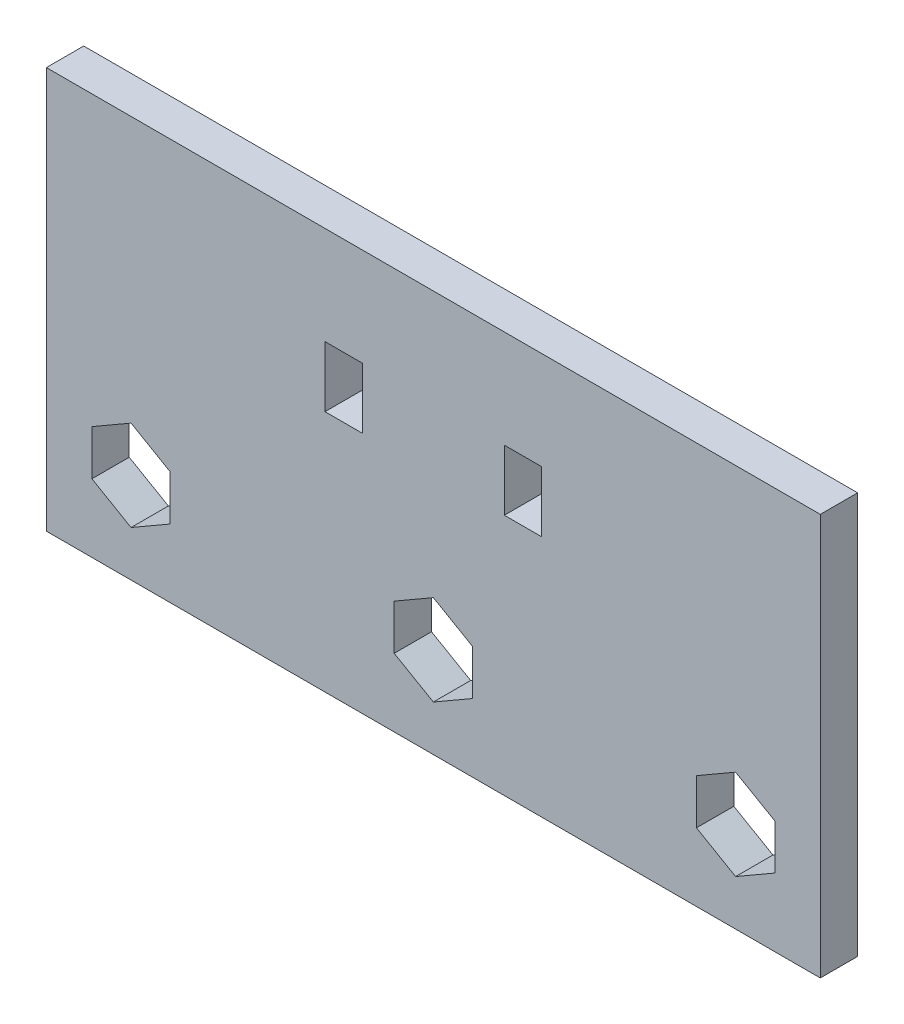
ISO-10303-21;
HEADER;
FILE_DESCRIPTION(('STEP AP214'),'2;1');
FILE_NAME('part.step','',(''),(''),'','','');
FILE_SCHEMA(('AUTOMOTIVE_DESIGN { 1 0 10303 214 1 1 1 1 }'));
ENDSEC;
DATA;
#1=APPLICATION_CONTEXT('core data for automotive mechanical design processes');
#2=APPLICATION_PROTOCOL_DEFINITION('international standard','automotive_design',2000,#1);
#3=PRODUCT_CONTEXT('',#1,'mechanical');
#4=PRODUCT('Part','Part','',(#3));
#5=PRODUCT_RELATED_PRODUCT_CATEGORY('part','',(#4));
#6=PRODUCT_DEFINITION_FORMATION('','',#4);
#7=PRODUCT_DEFINITION_CONTEXT('part definition',#1,'design');
#8=PRODUCT_DEFINITION('design','',#6,#7);
#9=PRODUCT_DEFINITION_SHAPE('','',#8);
#10=(LENGTH_UNIT() NAMED_UNIT(*) SI_UNIT(.MILLI.,.METRE.));
#11=(NAMED_UNIT(*) PLANE_ANGLE_UNIT() SI_UNIT($,.RADIAN.));
#12=(NAMED_UNIT(*) SI_UNIT($,.STERADIAN.) SOLID_ANGLE_UNIT());
#13=UNCERTAINTY_MEASURE_WITH_UNIT(LENGTH_MEASURE(1.E-05),#10,'distance_accuracy_value','');
#14=(GEOMETRIC_REPRESENTATION_CONTEXT(3) GLOBAL_UNCERTAINTY_ASSIGNED_CONTEXT((#13)) GLOBAL_UNIT_ASSIGNED_CONTEXT((#10,
#11,#12)) REPRESENTATION_CONTEXT('',''));
#15=CARTESIAN_POINT('',(0.,0.,0.));
#16=DIRECTION('',(0.,0.,1.));
#17=DIRECTION('',(1.,0.,0.));
#18=AXIS2_PLACEMENT_3D('',#15,#16,#17);
#19=CARTESIAN_POINT('',(0.,0.,5.207));
#20=DIRECTION('',(0.,0.,-1.));
#21=DIRECTION('',(-1.,0.,0.));
#22=AXIS2_PLACEMENT_3D('',#19,#20,#21);
#23=PLANE('',#22);
#24=DIRECTION('',(0.86602540378444,-0.499999999999998,0.));
#25=VECTOR('',#24,1.);
#26=CARTESIAN_POINT('',(16.2433806570155,28.1343605846325,5.207));
#27=LINE('',#26,#25);
#28=CARTESIAN_POINT('',(48.514,9.50290982004454,5.207));
#29=VERTEX_POINT('',#28);
#30=CARTESIAN_POINT('',(53.975,6.35,5.207));
#31=VERTEX_POINT('',#30);
#32=EDGE_CURVE('E321',#29,#31,#27,.T.);
#33=ORIENTED_EDGE('',*,*,#32,.F.);
#34=DIRECTION('',(0.,-1.,0.));
#35=VECTOR('',#34,1.);
#36=CARTESIAN_POINT('',(48.514,0.,5.207));
#37=LINE('',#36,#35);
#38=CARTESIAN_POINT('',(48.514,15.8087294601336,5.207));
#39=VERTEX_POINT('',#38);
#40=EDGE_CURVE('E310',#39,#29,#37,.T.);
#41=ORIENTED_EDGE('',*,*,#40,.F.);
#42=DIRECTION('',(-0.866025403784436,-0.500000000000004,0.));
#43=VECTOR('',#42,1.);
#44=CARTESIAN_POINT('',(5.28311934298456,-9.15063112449907,5.207));
#45=LINE('',#44,#43);
#46=CARTESIAN_POINT('',(53.975,18.9616392801782,5.207));
#47=VERTEX_POINT('',#46);
#48=EDGE_CURVE('E312',#47,#39,#45,.T.);
#49=ORIENTED_EDGE('',*,*,#48,.F.);
#50=DIRECTION('',(-0.86602540378444,0.499999999999998,0.));
#51=VECTOR('',#50,1.);
#52=CARTESIAN_POINT('',(21.7043806570155,37.5930900447662,5.207));
#53=LINE('',#52,#51);
#54=CARTESIAN_POINT('',(59.436,15.8087294601337,5.207));
#55=VERTEX_POINT('',#54);
#56=EDGE_CURVE('E315',#55,#47,#53,.T.);
#57=ORIENTED_EDGE('',*,*,#56,.F.);
#58=DIRECTION('',(0.,1.,0.));
#59=VECTOR('',#58,1.);
#60=CARTESIAN_POINT('',(59.436,0.,5.207));
#61=LINE('',#60,#59);
#62=CARTESIAN_POINT('',(59.436,9.50290982004458,5.207));
#63=VERTEX_POINT('',#62);
#64=EDGE_CURVE('E317',#63,#55,#61,.T.);
#65=ORIENTED_EDGE('',*,*,#64,.F.);
#66=DIRECTION('',(0.866025403784436,0.500000000000004,0.));
#67=VECTOR('',#66,1.);
#68=CARTESIAN_POINT('',(10.7441193429846,-18.6093605846327,5.207));
#69=LINE('',#68,#67);
#70=EDGE_CURVE('E319',#31,#63,#69,.T.);
#71=ORIENTED_EDGE('',*,*,#70,.F.);
#72=EDGE_LOOP('',(#33,#41,#49,#57,#65,#71));
#73=FACE_BOUND('',#72,.T.);
#74=DIRECTION('',(0.,-1.,0.));
#75=VECTOR('',#74,1.);
#76=CARTESIAN_POINT('',(0.,0.,5.207));
#77=LINE('',#76,#75);
#78=CARTESIAN_POINT('',(0.,56.007,5.207));
#79=VERTEX_POINT('',#78);
#80=CARTESIAN_POINT('',(0.,0.,5.207));
#81=VERTEX_POINT('',#80);
#82=EDGE_CURVE('E430',#79,#81,#77,.T.);
#83=ORIENTED_EDGE('',*,*,#82,.T.);
#84=DIRECTION('',(1.,0.,0.));
#85=VECTOR('',#84,1.);
#86=CARTESIAN_POINT('',(0.,0.,5.207));
#87=LINE('',#86,#85);
#88=CARTESIAN_POINT('',(107.95,0.,5.207));
#89=VERTEX_POINT('',#88);
#90=EDGE_CURVE('E433',#81,#89,#87,.T.);
#91=ORIENTED_EDGE('',*,*,#90,.T.);
#92=DIRECTION('',(0.,1.,0.));
#93=VECTOR('',#92,1.);
#94=CARTESIAN_POINT('',(107.95,0.,5.207));
#95=LINE('',#94,#93);
#96=CARTESIAN_POINT('',(107.95,56.007,5.207));
#97=VERTEX_POINT('',#96);
#98=EDGE_CURVE('E436',#89,#97,#95,.T.);
#99=ORIENTED_EDGE('',*,*,#98,.T.);
#100=DIRECTION('',(-1.,0.,0.));
#101=VECTOR('',#100,1.);
#102=CARTESIAN_POINT('',(0.,56.007,5.207));
#103=LINE('',#102,#101);
#104=EDGE_CURVE('E438',#97,#79,#103,.T.);
#105=ORIENTED_EDGE('',*,*,#104,.T.);
#106=EDGE_LOOP('',(#83,#91,#99,#105));
#107=FACE_BOUND('',#106,.T.);
#108=DIRECTION('',(-1.,0.,0.));
#109=VECTOR('',#108,1.);
#110=CARTESIAN_POINT('',(44.0690000000001,42.3333333333334,5.20700000000001));
#111=LINE('',#110,#109);
#112=CARTESIAN_POINT('',(44.0690000000001,42.3333333333334,5.20700000000001));
#113=VERTEX_POINT('',#112);
#114=CARTESIAN_POINT('',(38.8620000000001,42.3333333333334,5.207));
#115=VERTEX_POINT('',#114);
#116=EDGE_CURVE('E408',#113,#115,#111,.T.);
#117=ORIENTED_EDGE('',*,*,#116,.F.);
#118=DIRECTION('',(0.,-1.,0.));
#119=VECTOR('',#118,1.);
#120=CARTESIAN_POINT('',(44.0690000000001,0.,5.207));
#121=LINE('',#120,#119);
#122=CARTESIAN_POINT('',(44.0690000000001,33.8666666666667,5.20700000000001));
#123=VERTEX_POINT('',#122);
#124=EDGE_CURVE('E426',#113,#123,#121,.T.);
#125=ORIENTED_EDGE('',*,*,#124,.T.);
#126=DIRECTION('',(-1.,0.,0.));
#127=VECTOR('',#126,1.);
#128=CARTESIAN_POINT('',(44.0690000000001,33.8666666666667,5.20700000000001));
#129=LINE('',#128,#127);
#130=CARTESIAN_POINT('',(38.8620000000001,33.8666666666667,5.20700000000001));
#131=VERTEX_POINT('',#130);
#132=EDGE_CURVE('E421',#123,#131,#129,.T.);
#133=ORIENTED_EDGE('',*,*,#132,.T.);
#134=DIRECTION('',(0.,-1.,0.));
#135=VECTOR('',#134,1.);
#136=CARTESIAN_POINT('',(38.8620000000001,0.,5.207));
#137=LINE('',#136,#135);
#138=EDGE_CURVE('E424',#115,#131,#137,.T.);
#139=ORIENTED_EDGE('',*,*,#138,.F.);
#140=EDGE_LOOP('',(#117,#125,#133,#139));
#141=FACE_BOUND('',#140,.T.);
#142=DIRECTION('',(1.,0.,0.));
#143=VECTOR('',#142,1.);
#144=CARTESIAN_POINT('',(63.8810000000001,33.8666666666667,5.207));
#145=LINE('',#144,#143);
#146=CARTESIAN_POINT('',(63.8810000000001,33.8666666666667,5.207));
#147=VERTEX_POINT('',#146);
#148=CARTESIAN_POINT('',(69.0880000000001,33.8666666666667,5.207));
#149=VERTEX_POINT('',#148);
#150=EDGE_CURVE('E377',#147,#149,#145,.T.);
#151=ORIENTED_EDGE('',*,*,#150,.F.);
#152=DIRECTION('',(0.,1.,0.));
#153=VECTOR('',#152,1.);
#154=CARTESIAN_POINT('',(63.8810000000001,0.,5.207));
#155=LINE('',#154,#153);
#156=CARTESIAN_POINT('',(63.8810000000001,42.3333333333334,5.207));
#157=VERTEX_POINT('',#156);
#158=EDGE_CURVE('E395',#147,#157,#155,.T.);
#159=ORIENTED_EDGE('',*,*,#158,.T.);
#160=DIRECTION('',(1.,0.,0.));
#161=VECTOR('',#160,1.);
#162=CARTESIAN_POINT('',(63.8810000000001,42.3333333333334,5.207));
#163=LINE('',#162,#161);
#164=CARTESIAN_POINT('',(69.0880000000001,42.3333333333334,5.207));
#165=VERTEX_POINT('',#164);
#166=EDGE_CURVE('E390',#157,#165,#163,.T.);
#167=ORIENTED_EDGE('',*,*,#166,.T.);
#168=DIRECTION('',(0.,1.,0.));
#169=VECTOR('',#168,1.);
#170=CARTESIAN_POINT('',(69.0880000000001,0.,5.207));
#171=LINE('',#170,#169);
#172=EDGE_CURVE('E393',#149,#165,#171,.T.);
#173=ORIENTED_EDGE('',*,*,#172,.F.);
#174=EDGE_LOOP('',(#151,#159,#167,#173));
#175=FACE_BOUND('',#174,.T.);
#176=DIRECTION('',(0.,-1.,0.));
#177=VECTOR('',#176,1.);
#178=CARTESIAN_POINT('',(90.678,0.,5.207));
#179=LINE('',#178,#177);
#180=CARTESIAN_POINT('',(90.678,15.8087294601336,5.207));
#181=VERTEX_POINT('',#180);
#182=CARTESIAN_POINT('',(90.678,9.50290982004454,5.207));
#183=VERTEX_POINT('',#182);
#184=EDGE_CURVE('E365',#181,#183,#179,.T.);
#185=ORIENTED_EDGE('',*,*,#184,.F.);
#186=DIRECTION('',(-0.86602540378444,-0.499999999999998,0.));
#187=VECTOR('',#186,1.);
#188=CARTESIAN_POINT('',(15.8241193429842,-27.4081786870823,5.207));
#189=LINE('',#188,#187);
#190=CARTESIAN_POINT('',(96.139,18.9616392801782,5.207));
#191=VERTEX_POINT('',#190);
#192=EDGE_CURVE('E354',#191,#181,#189,.T.);
#193=ORIENTED_EDGE('',*,*,#192,.F.);
#194=DIRECTION('',(-0.86602540378444,0.499999999999998,0.));
#195=VECTOR('',#194,1.);
#196=CARTESIAN_POINT('',(32.2453806570154,55.8506376073496,5.207));
#197=LINE('',#196,#195);
#198=CARTESIAN_POINT('',(101.6,15.8087294601336,5.207));
#199=VERTEX_POINT('',#198);
#200=EDGE_CURVE('E356',#199,#191,#197,.T.);
#201=ORIENTED_EDGE('',*,*,#200,.F.);
#202=DIRECTION('',(0.,1.,0.));
#203=VECTOR('',#202,1.);
#204=CARTESIAN_POINT('',(101.6,0.,5.207));
#205=LINE('',#204,#203);
#206=CARTESIAN_POINT('',(101.6,9.50290982004454,5.207));
#207=VERTEX_POINT('',#206);
#208=EDGE_CURVE('E359',#207,#199,#205,.T.);
#209=ORIENTED_EDGE('',*,*,#208,.F.);
#210=DIRECTION('',(0.86602540378444,0.499999999999998,0.));
#211=VECTOR('',#210,1.);
#212=CARTESIAN_POINT('',(21.2851193429842,-36.8669081472159,5.207));
#213=LINE('',#212,#211);
#214=CARTESIAN_POINT('',(96.139,6.35000000000001,5.207));
#215=VERTEX_POINT('',#214);
#216=EDGE_CURVE('E361',#215,#207,#213,.T.);
#217=ORIENTED_EDGE('',*,*,#216,.F.);
#218=DIRECTION('',(0.86602540378444,-0.499999999999998,0.));
#219=VECTOR('',#218,1.);
#220=CARTESIAN_POINT('',(26.7843806570154,46.391908147216,5.207));
#221=LINE('',#220,#219);
#222=EDGE_CURVE('E363',#183,#215,#221,.T.);
#223=ORIENTED_EDGE('',*,*,#222,.F.);
#224=EDGE_LOOP('',(#185,#193,#201,#209,#217,#223));
#225=FACE_BOUND('',#224,.T.);
#226=DIRECTION('',(-0.86602540378444,-0.499999999999998,0.));
#227=VECTOR('',#226,1.);
#228=CARTESIAN_POINT('',(-5.25788065701559,9.10691643808469,5.207));
#229=LINE('',#228,#227);
#230=CARTESIAN_POINT('',(11.811,18.9616392801782,5.207));
#231=VERTEX_POINT('',#230);
#232=CARTESIAN_POINT('',(6.35,15.8087294601336,5.207));
#233=VERTEX_POINT('',#232);
#234=EDGE_CURVE('E233',#231,#233,#229,.T.);
#235=ORIENTED_EDGE('',*,*,#234,.F.);
#236=DIRECTION('',(-0.866025403784436,0.500000000000004,0.));
#237=VECTOR('',#236,1.);
#238=CARTESIAN_POINT('',(11.1633806570157,19.3355424821826,5.207));
#239=LINE('',#238,#237);
#240=CARTESIAN_POINT('',(17.272,15.8087294601336,5.207));
#241=VERTEX_POINT('',#240);
#242=EDGE_CURVE('E236',#241,#231,#239,.T.);
#243=ORIENTED_EDGE('',*,*,#242,.F.);
#244=DIRECTION('',(0.,1.,0.));
#245=VECTOR('',#244,1.);
#246=CARTESIAN_POINT('',(17.272,0.,5.207));
#247=LINE('',#246,#245);
#248=CARTESIAN_POINT('',(17.272,9.50290982004451,5.207));
#249=VERTEX_POINT('',#248);
#250=EDGE_CURVE('E270',#249,#241,#247,.T.);
#251=ORIENTED_EDGE('',*,*,#250,.F.);
#252=DIRECTION('',(0.86602540378444,0.499999999999998,0.));
#253=VECTOR('',#252,1.);
#254=CARTESIAN_POINT('',(0.203119342984393,-0.35181302204898,5.207));
#255=LINE('',#254,#253);
#256=CARTESIAN_POINT('',(11.811,6.34999999999998,5.207));
#257=VERTEX_POINT('',#256);
#258=EDGE_CURVE('E272',#257,#249,#255,.T.);
#259=ORIENTED_EDGE('',*,*,#258,.F.);
#260=DIRECTION('',(0.866025403784436,-0.500000000000004,0.));
#261=VECTOR('',#260,1.);
#262=CARTESIAN_POINT('',(5.70238065701565,9.87681302204898,5.207));
#263=LINE('',#262,#261);
#264=CARTESIAN_POINT('',(6.35,9.50290982004455,5.207));
#265=VERTEX_POINT('',#264);
#266=EDGE_CURVE('E274',#265,#257,#263,.T.);
#267=ORIENTED_EDGE('',*,*,#266,.F.);
#268=DIRECTION('',(0.,-1.,0.));
#269=VECTOR('',#268,1.);
#270=CARTESIAN_POINT('',(6.35,0.,5.207));
#271=LINE('',#270,#269);
#272=EDGE_CURVE('E276',#233,#265,#271,.T.);
#273=ORIENTED_EDGE('',*,*,#272,.F.);
#274=EDGE_LOOP('',(#235,#243,#251,#259,#267,#273));
#275=FACE_BOUND('',#274,.T.);
#276=ADVANCED_FACE('F33',(#73,#107,#141,#175,#225,#275),#23,.F.);
#277=CARTESIAN_POINT('',(0.,0.,0.));
#278=DIRECTION('',(0.,0.,-1.));
#279=DIRECTION('',(-1.,0.,0.));
#280=AXIS2_PLACEMENT_3D('',#277,#278,#279);
#281=PLANE('',#280);
#282=DIRECTION('',(0.,-1.,0.));
#283=VECTOR('',#282,1.);
#284=CARTESIAN_POINT('',(48.514,9.50290982004454,0.));
#285=LINE('',#284,#283);
#286=CARTESIAN_POINT('',(48.514,15.8087294601336,0.));
#287=VERTEX_POINT('',#286);
#288=CARTESIAN_POINT('',(48.514,9.50290982004454,0.));
#289=VERTEX_POINT('',#288);
#290=EDGE_CURVE('E294',#287,#289,#285,.T.);
#291=ORIENTED_EDGE('',*,*,#290,.T.);
#292=DIRECTION('',(0.86602540378444,-0.499999999999998,0.));
#293=VECTOR('',#292,1.);
#294=CARTESIAN_POINT('',(53.975,6.35,0.));
#295=LINE('',#294,#293);
#296=CARTESIAN_POINT('',(53.975,6.35,0.));
#297=VERTEX_POINT('',#296);
#298=EDGE_CURVE('E279',#289,#297,#295,.T.);
#299=ORIENTED_EDGE('',*,*,#298,.T.);
#300=DIRECTION('',(0.866025403784436,0.500000000000004,0.));
#301=VECTOR('',#300,1.);
#302=CARTESIAN_POINT('',(59.436,9.50290982004458,0.));
#303=LINE('',#302,#301);
#304=CARTESIAN_POINT('',(59.436,9.50290982004458,0.));
#305=VERTEX_POINT('',#304);
#306=EDGE_CURVE('E282',#297,#305,#303,.T.);
#307=ORIENTED_EDGE('',*,*,#306,.T.);
#308=DIRECTION('',(0.,1.,0.));
#309=VECTOR('',#308,1.);
#310=CARTESIAN_POINT('',(59.436,15.8087294601337,0.));
#311=LINE('',#310,#309);
#312=CARTESIAN_POINT('',(59.436,15.8087294601337,0.));
#313=VERTEX_POINT('',#312);
#314=EDGE_CURVE('E285',#305,#313,#311,.T.);
#315=ORIENTED_EDGE('',*,*,#314,.T.);
#316=DIRECTION('',(-0.86602540378444,0.499999999999998,0.));
#317=VECTOR('',#316,1.);
#318=CARTESIAN_POINT('',(53.975,18.9616392801782,0.));
#319=LINE('',#318,#317);
#320=CARTESIAN_POINT('',(53.975,18.9616392801782,0.));
#321=VERTEX_POINT('',#320);
#322=EDGE_CURVE('E288',#313,#321,#319,.T.);
#323=ORIENTED_EDGE('',*,*,#322,.T.);
#324=DIRECTION('',(-0.866025403784436,-0.500000000000004,0.));
#325=VECTOR('',#324,1.);
#326=CARTESIAN_POINT('',(48.514,15.8087294601336,0.));
#327=LINE('',#326,#325);
#328=EDGE_CURVE('E291',#321,#287,#327,.T.);
#329=ORIENTED_EDGE('',*,*,#328,.T.);
#330=EDGE_LOOP('',(#291,#299,#307,#315,#323,#329));
#331=FACE_BOUND('',#330,.T.);
#332=DIRECTION('',(0.,-1.,0.));
#333=VECTOR('',#332,1.);
#334=CARTESIAN_POINT('',(0.,0.,0.));
#335=LINE('',#334,#333);
#336=CARTESIAN_POINT('',(0.,56.007,0.));
#337=VERTEX_POINT('',#336);
#338=CARTESIAN_POINT('',(0.,0.,0.));
#339=VERTEX_POINT('',#338);
#340=EDGE_CURVE('E429',#337,#339,#335,.T.);
#341=ORIENTED_EDGE('',*,*,#340,.F.);
#342=DIRECTION('',(-1.,0.,0.));
#343=VECTOR('',#342,1.);
#344=CARTESIAN_POINT('',(0.,56.007,0.));
#345=LINE('',#344,#343);
#346=CARTESIAN_POINT('',(107.95,56.007,0.));
#347=VERTEX_POINT('',#346);
#348=EDGE_CURVE('E434',#347,#337,#345,.T.);
#349=ORIENTED_EDGE('',*,*,#348,.F.);
#350=DIRECTION('',(0.,1.,0.));
#351=VECTOR('',#350,1.);
#352=CARTESIAN_POINT('',(107.95,0.,0.));
#353=LINE('',#352,#351);
#354=CARTESIAN_POINT('',(107.95,0.,0.));
#355=VERTEX_POINT('',#354);
#356=EDGE_CURVE('E445',#355,#347,#353,.T.);
#357=ORIENTED_EDGE('',*,*,#356,.F.);
#358=DIRECTION('',(1.,0.,0.));
#359=VECTOR('',#358,1.);
#360=CARTESIAN_POINT('',(0.,0.,0.));
#361=LINE('',#360,#359);
#362=EDGE_CURVE('E443',#339,#355,#361,.T.);
#363=ORIENTED_EDGE('',*,*,#362,.F.);
#364=EDGE_LOOP('',(#341,#349,#357,#363));
#365=FACE_BOUND('',#364,.T.);
#366=DIRECTION('',(0.,1.,0.));
#367=VECTOR('',#366,1.);
#368=CARTESIAN_POINT('',(44.0690000000001,33.8666666666667,0.));
#369=LINE('',#368,#367);
#370=CARTESIAN_POINT('',(44.0690000000001,33.8666666666667,0.));
#371=VERTEX_POINT('',#370);
#372=CARTESIAN_POINT('',(44.0690000000001,42.3333333333334,0.));
#373=VERTEX_POINT('',#372);
#374=EDGE_CURVE('E401',#371,#373,#369,.T.);
#375=ORIENTED_EDGE('',*,*,#374,.T.);
#376=DIRECTION('',(-1.,0.,0.));
#377=VECTOR('',#376,1.);
#378=CARTESIAN_POINT('',(44.0690000000001,42.3333333333334,0.));
#379=LINE('',#378,#377);
#380=CARTESIAN_POINT('',(38.8620000000001,42.3333333333334,0.));
#381=VERTEX_POINT('',#380);
#382=EDGE_CURVE('E416',#373,#381,#379,.T.);
#383=ORIENTED_EDGE('',*,*,#382,.T.);
#384=DIRECTION('',(0.,1.,0.));
#385=VECTOR('',#384,1.);
#386=CARTESIAN_POINT('',(38.8620000000001,33.8666666666667,0.));
#387=LINE('',#386,#385);
#388=CARTESIAN_POINT('',(38.8620000000001,33.8666666666667,0.));
#389=VERTEX_POINT('',#388);
#390=EDGE_CURVE('E411',#389,#381,#387,.T.);
#391=ORIENTED_EDGE('',*,*,#390,.F.);
#392=DIRECTION('',(-1.,0.,0.));
#393=VECTOR('',#392,1.);
#394=CARTESIAN_POINT('',(44.0690000000001,33.8666666666667,0.));
#395=LINE('',#394,#393);
#396=EDGE_CURVE('E419',#371,#389,#395,.T.);
#397=ORIENTED_EDGE('',*,*,#396,.F.);
#398=EDGE_LOOP('',(#375,#383,#391,#397));
#399=FACE_BOUND('',#398,.T.);
#400=DIRECTION('',(0.,-1.,0.));
#401=VECTOR('',#400,1.);
#402=CARTESIAN_POINT('',(63.8810000000001,33.8666666666667,0.));
#403=LINE('',#402,#401);
#404=CARTESIAN_POINT('',(63.8810000000001,42.3333333333334,0.));
#405=VERTEX_POINT('',#404);
#406=CARTESIAN_POINT('',(63.8810000000001,33.8666666666667,0.));
#407=VERTEX_POINT('',#406);
#408=EDGE_CURVE('E370',#405,#407,#403,.T.);
#409=ORIENTED_EDGE('',*,*,#408,.T.);
#410=DIRECTION('',(1.,0.,0.));
#411=VECTOR('',#410,1.);
#412=CARTESIAN_POINT('',(63.8810000000001,33.8666666666667,0.));
#413=LINE('',#412,#411);
#414=CARTESIAN_POINT('',(69.0880000000001,33.8666666666667,0.));
#415=VERTEX_POINT('',#414);
#416=EDGE_CURVE('E385',#407,#415,#413,.T.);
#417=ORIENTED_EDGE('',*,*,#416,.T.);
#418=DIRECTION('',(0.,-1.,0.));
#419=VECTOR('',#418,1.);
#420=CARTESIAN_POINT('',(69.0880000000001,33.8666666666667,0.));
#421=LINE('',#420,#419);
#422=CARTESIAN_POINT('',(69.0880000000001,42.3333333333334,0.));
#423=VERTEX_POINT('',#422);
#424=EDGE_CURVE('E380',#423,#415,#421,.T.);
#425=ORIENTED_EDGE('',*,*,#424,.F.);
#426=DIRECTION('',(1.,0.,0.));
#427=VECTOR('',#426,1.);
#428=CARTESIAN_POINT('',(63.8810000000001,42.3333333333334,0.));
#429=LINE('',#428,#427);
#430=EDGE_CURVE('E388',#405,#423,#429,.T.);
#431=ORIENTED_EDGE('',*,*,#430,.F.);
#432=EDGE_LOOP('',(#409,#417,#425,#431));
#433=FACE_BOUND('',#432,.T.);
#434=DIRECTION('',(-0.86602540378444,-0.499999999999998,0.));
#435=VECTOR('',#434,1.);
#436=CARTESIAN_POINT('',(90.678,15.8087294601336,0.));
#437=LINE('',#436,#435);
#438=CARTESIAN_POINT('',(96.139,18.9616392801782,0.));
#439=VERTEX_POINT('',#438);
#440=CARTESIAN_POINT('',(90.678,15.8087294601336,0.));
#441=VERTEX_POINT('',#440);
#442=EDGE_CURVE('E338',#439,#441,#437,.T.);
#443=ORIENTED_EDGE('',*,*,#442,.T.);
#444=DIRECTION('',(0.,-1.,0.));
#445=VECTOR('',#444,1.);
#446=CARTESIAN_POINT('',(90.678,9.50290982004454,0.));
#447=LINE('',#446,#445);
#448=CARTESIAN_POINT('',(90.678,9.50290982004454,0.));
#449=VERTEX_POINT('',#448);
#450=EDGE_CURVE('E323',#441,#449,#447,.T.);
#451=ORIENTED_EDGE('',*,*,#450,.T.);
#452=DIRECTION('',(0.86602540378444,-0.499999999999998,0.));
#453=VECTOR('',#452,1.);
#454=CARTESIAN_POINT('',(96.139,6.35000000000001,0.));
#455=LINE('',#454,#453);
#456=CARTESIAN_POINT('',(96.139,6.35000000000001,0.));
#457=VERTEX_POINT('',#456);
#458=EDGE_CURVE('E326',#449,#457,#455,.T.);
#459=ORIENTED_EDGE('',*,*,#458,.T.);
#460=DIRECTION('',(0.86602540378444,0.499999999999998,0.));
#461=VECTOR('',#460,1.);
#462=CARTESIAN_POINT('',(101.6,9.50290982004454,0.));
#463=LINE('',#462,#461);
#464=CARTESIAN_POINT('',(101.6,9.50290982004454,0.));
#465=VERTEX_POINT('',#464);
#466=EDGE_CURVE('E329',#457,#465,#463,.T.);
#467=ORIENTED_EDGE('',*,*,#466,.T.);
#468=DIRECTION('',(0.,1.,0.));
#469=VECTOR('',#468,1.);
#470=CARTESIAN_POINT('',(101.6,15.8087294601336,0.));
#471=LINE('',#470,#469);
#472=CARTESIAN_POINT('',(101.6,15.8087294601336,0.));
#473=VERTEX_POINT('',#472);
#474=EDGE_CURVE('E332',#465,#473,#471,.T.);
#475=ORIENTED_EDGE('',*,*,#474,.T.);
#476=DIRECTION('',(-0.86602540378444,0.499999999999998,0.));
#477=VECTOR('',#476,1.);
#478=CARTESIAN_POINT('',(96.139,18.9616392801782,0.));
#479=LINE('',#478,#477);
#480=EDGE_CURVE('E335',#473,#439,#479,.T.);
#481=ORIENTED_EDGE('',*,*,#480,.T.);
#482=EDGE_LOOP('',(#443,#451,#459,#467,#475,#481));
#483=FACE_BOUND('',#482,.T.);
#484=DIRECTION('',(-0.866025403784436,0.500000000000004,0.));
#485=VECTOR('',#484,1.);
#486=CARTESIAN_POINT('',(11.811,18.9616392801782,0.));
#487=LINE('',#486,#485);
#488=CARTESIAN_POINT('',(17.272,15.8087294601336,0.));
#489=VERTEX_POINT('',#488);
#490=CARTESIAN_POINT('',(11.811,18.9616392801782,0.));
#491=VERTEX_POINT('',#490);
#492=EDGE_CURVE('E251',#489,#491,#487,.T.);
#493=ORIENTED_EDGE('',*,*,#492,.T.);
#494=DIRECTION('',(-0.86602540378444,-0.499999999999998,0.));
#495=VECTOR('',#494,1.);
#496=CARTESIAN_POINT('',(6.35,15.8087294601336,0.));
#497=LINE('',#496,#495);
#498=CARTESIAN_POINT('',(6.35,15.8087294601336,0.));
#499=VERTEX_POINT('',#498);
#500=EDGE_CURVE('E56',#491,#499,#497,.T.);
#501=ORIENTED_EDGE('',*,*,#500,.T.);
#502=DIRECTION('',(0.,-1.,0.));
#503=VECTOR('',#502,1.);
#504=CARTESIAN_POINT('',(6.35,9.50290982004455,0.));
#505=LINE('',#504,#503);
#506=CARTESIAN_POINT('',(6.35,9.50290982004455,0.));
#507=VERTEX_POINT('',#506);
#508=EDGE_CURVE('E240',#499,#507,#505,.T.);
#509=ORIENTED_EDGE('',*,*,#508,.T.);
#510=DIRECTION('',(0.866025403784436,-0.500000000000004,0.));
#511=VECTOR('',#510,1.);
#512=CARTESIAN_POINT('',(11.811,6.34999999999998,0.));
#513=LINE('',#512,#511);
#514=CARTESIAN_POINT('',(11.811,6.34999999999998,0.));
#515=VERTEX_POINT('',#514);
#516=EDGE_CURVE('E246',#507,#515,#513,.T.);
#517=ORIENTED_EDGE('',*,*,#516,.T.);
#518=DIRECTION('',(0.86602540378444,0.499999999999998,0.));
#519=VECTOR('',#518,1.);
#520=CARTESIAN_POINT('',(17.272,9.50290982004451,0.));
#521=LINE('',#520,#519);
#522=CARTESIAN_POINT('',(17.272,9.50290982004451,0.));
#523=VERTEX_POINT('',#522);
#524=EDGE_CURVE('E255',#515,#523,#521,.T.);
#525=ORIENTED_EDGE('',*,*,#524,.T.);
#526=DIRECTION('',(0.,1.,0.));
#527=VECTOR('',#526,1.);
#528=CARTESIAN_POINT('',(17.272,15.8087294601336,0.));
#529=LINE('',#528,#527);
#530=EDGE_CURVE('E258',#523,#489,#529,.T.);
#531=ORIENTED_EDGE('',*,*,#530,.T.);
#532=EDGE_LOOP('',(#493,#501,#509,#517,#525,#531));
#533=FACE_BOUND('',#532,.T.);
#534=ADVANCED_FACE('F249',(#331,#365,#399,#433,#483,#533),#281,.T.);
#535=CARTESIAN_POINT('',(0.,0.,5.207));
#536=DIRECTION('',(1.,0.,0.));
#537=DIRECTION('',(0.,0.,-1.));
#538=AXIS2_PLACEMENT_3D('',#535,#536,#537);
#539=PLANE('',#538);
#540=ORIENTED_EDGE('',*,*,#340,.T.);
#541=DIRECTION('',(0.,0.,-1.));
#542=VECTOR('',#541,1.);
#543=CARTESIAN_POINT('',(0.,0.,5.207));
#544=LINE('',#543,#542);
#545=EDGE_CURVE('E11',#81,#339,#544,.T.);
#546=ORIENTED_EDGE('',*,*,#545,.F.);
#547=ORIENTED_EDGE('',*,*,#82,.F.);
#548=DIRECTION('',(0.,0.,-1.));
#549=VECTOR('',#548,1.);
#550=CARTESIAN_POINT('',(0.,56.007,5.207));
#551=LINE('',#550,#549);
#552=EDGE_CURVE('E440',#79,#337,#551,.T.);
#553=ORIENTED_EDGE('',*,*,#552,.T.);
#554=EDGE_LOOP('',(#540,#546,#547,#553));
#555=FACE_BOUND('',#554,.T.);
#556=ADVANCED_FACE('F35',(#555),#539,.F.);
#557=CARTESIAN_POINT('',(0.,0.,5.207));
#558=DIRECTION('',(0.,1.,0.));
#559=DIRECTION('',(0.,0.,1.));
#560=AXIS2_PLACEMENT_3D('',#557,#558,#559);
#561=PLANE('',#560);
#562=ORIENTED_EDGE('',*,*,#362,.T.);
#563=DIRECTION('',(0.,0.,-1.));
#564=VECTOR('',#563,1.);
#565=CARTESIAN_POINT('',(107.95,0.,5.207));
#566=LINE('',#565,#564);
#567=EDGE_CURVE('E41',#89,#355,#566,.T.);
#568=ORIENTED_EDGE('',*,*,#567,.F.);
#569=ORIENTED_EDGE('',*,*,#90,.F.);
#570=ORIENTED_EDGE('',*,*,#545,.T.);
#571=EDGE_LOOP('',(#562,#568,#569,#570));
#572=FACE_BOUND('',#571,.T.);
#573=ADVANCED_FACE('F473',(#572),#561,.F.);
#574=CARTESIAN_POINT('',(107.95,0.,5.207));
#575=DIRECTION('',(-1.,0.,0.));
#576=DIRECTION('',(0.,0.,1.));
#577=AXIS2_PLACEMENT_3D('',#574,#575,#576);
#578=PLANE('',#577);
#579=ORIENTED_EDGE('',*,*,#356,.T.);
#580=DIRECTION('',(0.,0.,-1.));
#581=VECTOR('',#580,1.);
#582=CARTESIAN_POINT('',(107.95,56.007,5.207));
#583=LINE('',#582,#581);
#584=EDGE_CURVE('E450',#97,#347,#583,.T.);
#585=ORIENTED_EDGE('',*,*,#584,.F.);
#586=ORIENTED_EDGE('',*,*,#98,.F.);
#587=ORIENTED_EDGE('',*,*,#567,.T.);
#588=EDGE_LOOP('',(#579,#585,#586,#587));
#589=FACE_BOUND('',#588,.T.);
#590=ADVANCED_FACE('F457',(#589),#578,.F.);
#591=CARTESIAN_POINT('',(0.,56.007,5.207));
#592=DIRECTION('',(0.,-1.,0.));
#593=DIRECTION('',(0.,0.,-1.));
#594=AXIS2_PLACEMENT_3D('',#591,#592,#593);
#595=PLANE('',#594);
#596=ORIENTED_EDGE('',*,*,#348,.T.);
#597=ORIENTED_EDGE('',*,*,#552,.F.);
#598=ORIENTED_EDGE('',*,*,#104,.F.);
#599=ORIENTED_EDGE('',*,*,#584,.T.);
#600=EDGE_LOOP('',(#596,#597,#598,#599));
#601=FACE_BOUND('',#600,.T.);
#602=ADVANCED_FACE('F466',(#601),#595,.F.);
#603=CARTESIAN_POINT('',(44.0690000000001,31.5471849402194,13.1016330472843));
#604=DIRECTION('',(1.,0.,0.));
#605=DIRECTION('',(0.,1.,0.));
#606=AXIS2_PLACEMENT_3D('',#603,#604,#605);
#607=PLANE('',#606);
#608=DIRECTION('',(0.,0.,1.));
#609=VECTOR('',#608,1.);
#610=CARTESIAN_POINT('',(44.0690000000001,42.3333333333334,5.20700000000001));
#611=LINE('',#610,#609);
#612=EDGE_CURVE('E405',#373,#113,#611,.T.);
#613=ORIENTED_EDGE('',*,*,#612,.F.);
#614=ORIENTED_EDGE('',*,*,#374,.F.);
#615=DIRECTION('',(0.,0.,-1.));
#616=VECTOR('',#615,1.);
#617=CARTESIAN_POINT('',(44.0690000000001,33.8666666666667,5.20700000000001));
#618=LINE('',#617,#616);
#619=EDGE_CURVE('E399',#123,#371,#618,.T.);
#620=ORIENTED_EDGE('',*,*,#619,.F.);
#621=ORIENTED_EDGE('',*,*,#124,.F.);
#622=EDGE_LOOP('',(#613,#614,#620,#621));
#623=FACE_BOUND('',#622,.T.);
#624=ADVANCED_FACE('F495',(#623),#607,.F.);
#625=CARTESIAN_POINT('',(38.8620000000001,31.5471849402194,13.1016330472843));
#626=DIRECTION('',(1.,0.,0.));
#627=DIRECTION('',(0.,1.,0.));
#628=AXIS2_PLACEMENT_3D('',#625,#626,#627);
#629=PLANE('',#628);
#630=ORIENTED_EDGE('',*,*,#138,.T.);
#631=DIRECTION('',(0.,0.,-1.));
#632=VECTOR('',#631,1.);
#633=CARTESIAN_POINT('',(38.8620000000001,33.8666666666667,5.20700000000001));
#634=LINE('',#633,#632);
#635=EDGE_CURVE('E398',#131,#389,#634,.T.);
#636=ORIENTED_EDGE('',*,*,#635,.T.);
#637=ORIENTED_EDGE('',*,*,#390,.T.);
#638=DIRECTION('',(0.,0.,1.));
#639=VECTOR('',#638,1.);
#640=CARTESIAN_POINT('',(38.8620000000001,42.3333333333334,5.20700000000001));
#641=LINE('',#640,#639);
#642=EDGE_CURVE('E402',#381,#115,#641,.T.);
#643=ORIENTED_EDGE('',*,*,#642,.T.);
#644=EDGE_LOOP('',(#630,#636,#637,#643));
#645=FACE_BOUND('',#644,.T.);
#646=ADVANCED_FACE('F500',(#645),#629,.T.);
#647=CARTESIAN_POINT('',(44.0690000000001,33.8666666666667,5.20700000000001));
#648=DIRECTION('',(0.,1.,0.));
#649=DIRECTION('',(0.,0.,1.));
#650=AXIS2_PLACEMENT_3D('',#647,#648,#649);
#651=PLANE('',#650);
#652=ORIENTED_EDGE('',*,*,#635,.F.);
#653=ORIENTED_EDGE('',*,*,#132,.F.);
#654=ORIENTED_EDGE('',*,*,#619,.T.);
#655=ORIENTED_EDGE('',*,*,#396,.T.);
#656=EDGE_LOOP('',(#652,#653,#654,#655));
#657=FACE_BOUND('',#656,.T.);
#658=ADVANCED_FACE('F491',(#657),#651,.T.);
#659=CARTESIAN_POINT('',(44.0690000000001,42.3333333333334,5.20700000000001));
#660=DIRECTION('',(0.,-1.,0.));
#661=DIRECTION('',(0.,0.,-1.));
#662=AXIS2_PLACEMENT_3D('',#659,#660,#661);
#663=PLANE('',#662);
#664=ORIENTED_EDGE('',*,*,#642,.F.);
#665=ORIENTED_EDGE('',*,*,#382,.F.);
#666=ORIENTED_EDGE('',*,*,#612,.T.);
#667=ORIENTED_EDGE('',*,*,#116,.T.);
#668=EDGE_LOOP('',(#664,#665,#666,#667));
#669=FACE_BOUND('',#668,.T.);
#670=ADVANCED_FACE('F512',(#669),#663,.T.);
#671=CARTESIAN_POINT('',(63.8810000000001,31.5471849402194,22.7123669527158));
#672=DIRECTION('',(-1.,0.,0.));
#673=DIRECTION('',(0.,1.,0.));
#674=AXIS2_PLACEMENT_3D('',#671,#672,#673);
#675=PLANE('',#674);
#676=DIRECTION('',(0.,0.,1.));
#677=VECTOR('',#676,1.);
#678=CARTESIAN_POINT('',(63.8810000000001,33.8666666666667,5.207));
#679=LINE('',#678,#677);
#680=EDGE_CURVE('E374',#407,#147,#679,.T.);
#681=ORIENTED_EDGE('',*,*,#680,.F.);
#682=ORIENTED_EDGE('',*,*,#408,.F.);
#683=DIRECTION('',(0.,0.,-1.));
#684=VECTOR('',#683,1.);
#685=CARTESIAN_POINT('',(63.8810000000001,42.3333333333334,5.207));
#686=LINE('',#685,#684);
#687=EDGE_CURVE('E368',#157,#405,#686,.T.);
#688=ORIENTED_EDGE('',*,*,#687,.F.);
#689=ORIENTED_EDGE('',*,*,#158,.F.);
#690=EDGE_LOOP('',(#681,#682,#688,#689));
#691=FACE_BOUND('',#690,.T.);
#692=ADVANCED_FACE('F514',(#691),#675,.F.);
#693=CARTESIAN_POINT('',(69.0880000000001,31.5471849402194,22.7123669527158));
#694=DIRECTION('',(-1.,0.,0.));
#695=DIRECTION('',(0.,1.,0.));
#696=AXIS2_PLACEMENT_3D('',#693,#694,#695);
#697=PLANE('',#696);
#698=ORIENTED_EDGE('',*,*,#172,.T.);
#699=DIRECTION('',(0.,0.,-1.));
#700=VECTOR('',#699,1.);
#701=CARTESIAN_POINT('',(69.0880000000001,42.3333333333334,5.207));
#702=LINE('',#701,#700);
#703=EDGE_CURVE('E367',#165,#423,#702,.T.);
#704=ORIENTED_EDGE('',*,*,#703,.T.);
#705=ORIENTED_EDGE('',*,*,#424,.T.);
#706=DIRECTION('',(0.,0.,1.));
#707=VECTOR('',#706,1.);
#708=CARTESIAN_POINT('',(69.0880000000001,33.8666666666667,5.207));
#709=LINE('',#708,#707);
#710=EDGE_CURVE('E371',#415,#149,#709,.T.);
#711=ORIENTED_EDGE('',*,*,#710,.T.);
#712=EDGE_LOOP('',(#698,#704,#705,#711));
#713=FACE_BOUND('',#712,.T.);
#714=ADVANCED_FACE('F520',(#713),#697,.T.);
#715=CARTESIAN_POINT('',(63.8810000000001,42.3333333333334,5.207));
#716=DIRECTION('',(0.,-1.,0.));
#717=DIRECTION('',(-1.,0.,0.));
#718=AXIS2_PLACEMENT_3D('',#715,#716,#717);
#719=PLANE('',#718);
#720=ORIENTED_EDGE('',*,*,#703,.F.);
#721=ORIENTED_EDGE('',*,*,#166,.F.);
#722=ORIENTED_EDGE('',*,*,#687,.T.);
#723=ORIENTED_EDGE('',*,*,#430,.T.);
#724=EDGE_LOOP('',(#720,#721,#722,#723));
#725=FACE_BOUND('',#724,.T.);
#726=ADVANCED_FACE('F510',(#725),#719,.T.);
#727=CARTESIAN_POINT('',(63.8810000000001,33.8666666666667,5.207));
#728=DIRECTION('',(0.,1.,0.));
#729=DIRECTION('',(0.,0.,-1.));
#730=AXIS2_PLACEMENT_3D('',#727,#728,#729);
#731=PLANE('',#730);
#732=ORIENTED_EDGE('',*,*,#710,.F.);
#733=ORIENTED_EDGE('',*,*,#416,.F.);
#734=ORIENTED_EDGE('',*,*,#680,.T.);
#735=ORIENTED_EDGE('',*,*,#150,.T.);
#736=EDGE_LOOP('',(#732,#733,#734,#735));
#737=FACE_BOUND('',#736,.T.);
#738=ADVANCED_FACE('F616',(#737),#731,.T.);
#739=CARTESIAN_POINT('',(90.678,9.50290982004454,12.7));
#740=DIRECTION('',(1.,0.,0.));
#741=DIRECTION('',(0.,1.,0.));
#742=AXIS2_PLACEMENT_3D('',#739,#740,#741);
#743=PLANE('',#742);
#744=ORIENTED_EDGE('',*,*,#184,.T.);
#745=DIRECTION('',(0.,0.,-1.));
#746=VECTOR('',#745,1.);
#747=CARTESIAN_POINT('',(90.678,9.50290982004454,12.7));
#748=LINE('',#747,#746);
#749=EDGE_CURVE('E352',#183,#449,#748,.T.);
#750=ORIENTED_EDGE('',*,*,#749,.T.);
#751=ORIENTED_EDGE('',*,*,#450,.F.);
#752=DIRECTION('',(0.,0.,-1.));
#753=VECTOR('',#752,1.);
#754=CARTESIAN_POINT('',(90.678,15.8087294601336,12.7));
#755=LINE('',#754,#753);
#756=EDGE_CURVE('E341',#181,#441,#755,.T.);
#757=ORIENTED_EDGE('',*,*,#756,.F.);
#758=EDGE_LOOP('',(#744,#750,#751,#757));
#759=FACE_BOUND('',#758,.T.);
#760=ADVANCED_FACE('F614',(#759),#743,.T.);
#761=CARTESIAN_POINT('',(96.139,6.35000000000001,12.7));
#762=DIRECTION('',(0.499999999999998,0.86602540378444,0.));
#763=DIRECTION('',(-0.86602540378444,0.499999999999998,0.));
#764=AXIS2_PLACEMENT_3D('',#761,#762,#763);
#765=PLANE('',#764);
#766=ORIENTED_EDGE('',*,*,#222,.T.);
#767=DIRECTION('',(0.,0.,-1.));
#768=VECTOR('',#767,1.);
#769=CARTESIAN_POINT('',(96.139,6.35000000000001,12.7));
#770=LINE('',#769,#768);
#771=EDGE_CURVE('E350',#215,#457,#770,.T.);
#772=ORIENTED_EDGE('',*,*,#771,.T.);
#773=ORIENTED_EDGE('',*,*,#458,.F.);
#774=ORIENTED_EDGE('',*,*,#749,.F.);
#775=EDGE_LOOP('',(#766,#772,#773,#774));
#776=FACE_BOUND('',#775,.T.);
#777=ADVANCED_FACE('F610',(#776),#765,.T.);
#778=CARTESIAN_POINT('',(101.6,9.50290982004454,12.7));
#779=DIRECTION('',(-0.499999999999998,0.86602540378444,0.));
#780=DIRECTION('',(0.,0.,1.));
#781=AXIS2_PLACEMENT_3D('',#778,#779,#780);
#782=PLANE('',#781);
#783=ORIENTED_EDGE('',*,*,#216,.T.);
#784=DIRECTION('',(0.,0.,-1.));
#785=VECTOR('',#784,1.);
#786=CARTESIAN_POINT('',(101.6,9.50290982004454,12.7));
#787=LINE('',#786,#785);
#788=EDGE_CURVE('E348',#207,#465,#787,.T.);
#789=ORIENTED_EDGE('',*,*,#788,.T.);
#790=ORIENTED_EDGE('',*,*,#466,.F.);
#791=ORIENTED_EDGE('',*,*,#771,.F.);
#792=EDGE_LOOP('',(#783,#789,#790,#791));
#793=FACE_BOUND('',#792,.T.);
#794=ADVANCED_FACE('F606',(#793),#782,.T.);
#795=CARTESIAN_POINT('',(101.6,15.8087294601336,12.7));
#796=DIRECTION('',(-1.,0.,0.));
#797=DIRECTION('',(0.,-1.,0.));
#798=AXIS2_PLACEMENT_3D('',#795,#796,#797);
#799=PLANE('',#798);
#800=ORIENTED_EDGE('',*,*,#208,.T.);
#801=DIRECTION('',(0.,0.,-1.));
#802=VECTOR('',#801,1.);
#803=CARTESIAN_POINT('',(101.6,15.8087294601336,12.7));
#804=LINE('',#803,#802);
#805=EDGE_CURVE('E346',#199,#473,#804,.T.);
#806=ORIENTED_EDGE('',*,*,#805,.T.);
#807=ORIENTED_EDGE('',*,*,#474,.F.);
#808=ORIENTED_EDGE('',*,*,#788,.F.);
#809=EDGE_LOOP('',(#800,#806,#807,#808));
#810=FACE_BOUND('',#809,.T.);
#811=ADVANCED_FACE('F602',(#810),#799,.T.);
#812=CARTESIAN_POINT('',(96.139,18.9616392801782,12.7));
#813=DIRECTION('',(-0.499999999999998,-0.86602540378444,0.));
#814=DIRECTION('',(0.86602540378444,-0.499999999999998,0.));
#815=AXIS2_PLACEMENT_3D('',#812,#813,#814);
#816=PLANE('',#815);
#817=ORIENTED_EDGE('',*,*,#200,.T.);
#818=DIRECTION('',(0.,0.,-1.));
#819=VECTOR('',#818,1.);
#820=CARTESIAN_POINT('',(96.139,18.9616392801782,12.7));
#821=LINE('',#820,#819);
#822=EDGE_CURVE('E344',#191,#439,#821,.T.);
#823=ORIENTED_EDGE('',*,*,#822,.T.);
#824=ORIENTED_EDGE('',*,*,#480,.F.);
#825=ORIENTED_EDGE('',*,*,#805,.F.);
#826=EDGE_LOOP('',(#817,#823,#824,#825));
#827=FACE_BOUND('',#826,.T.);
#828=ADVANCED_FACE('F598',(#827),#816,.T.);
#829=CARTESIAN_POINT('',(90.678,15.8087294601336,12.7));
#830=DIRECTION('',(0.499999999999998,-0.86602540378444,0.));
#831=DIRECTION('',(0.,0.,-1.));
#832=AXIS2_PLACEMENT_3D('',#829,#830,#831);
#833=PLANE('',#832);
#834=ORIENTED_EDGE('',*,*,#192,.T.);
#835=ORIENTED_EDGE('',*,*,#756,.T.);
#836=ORIENTED_EDGE('',*,*,#442,.F.);
#837=ORIENTED_EDGE('',*,*,#822,.F.);
#838=EDGE_LOOP('',(#834,#835,#836,#837));
#839=FACE_BOUND('',#838,.T.);
#840=ADVANCED_FACE('F594',(#839),#833,.T.);
#841=CARTESIAN_POINT('',(53.975,6.35,12.7));
#842=DIRECTION('',(0.499999999999998,0.86602540378444,0.));
#843=DIRECTION('',(-0.86602540378444,0.499999999999998,0.));
#844=AXIS2_PLACEMENT_3D('',#841,#842,#843);
#845=PLANE('',#844);
#846=ORIENTED_EDGE('',*,*,#32,.T.);
#847=DIRECTION('',(0.,0.,-1.));
#848=VECTOR('',#847,1.);
#849=CARTESIAN_POINT('',(53.975,6.35,12.7));
#850=LINE('',#849,#848);
#851=EDGE_CURVE('E308',#31,#297,#850,.T.);
#852=ORIENTED_EDGE('',*,*,#851,.T.);
#853=ORIENTED_EDGE('',*,*,#298,.F.);
#854=DIRECTION('',(0.,0.,-1.));
#855=VECTOR('',#854,1.);
#856=CARTESIAN_POINT('',(48.514,9.50290982004454,12.7));
#857=LINE('',#856,#855);
#858=EDGE_CURVE('E297',#29,#289,#857,.T.);
#859=ORIENTED_EDGE('',*,*,#858,.F.);
#860=EDGE_LOOP('',(#846,#852,#853,#859));
#861=FACE_BOUND('',#860,.T.);
#862=ADVANCED_FACE('F590',(#861),#845,.T.);
#863=CARTESIAN_POINT('',(59.436,9.50290982004458,12.7));
#864=DIRECTION('',(-0.500000000000004,0.866025403784436,0.));
#865=DIRECTION('',(-0.866025403784436,-0.500000000000004,0.));
#866=AXIS2_PLACEMENT_3D('',#863,#864,#865);
#867=PLANE('',#866);
#868=ORIENTED_EDGE('',*,*,#70,.T.);
#869=DIRECTION('',(0.,0.,-1.));
#870=VECTOR('',#869,1.);
#871=CARTESIAN_POINT('',(59.436,9.50290982004458,12.7));
#872=LINE('',#871,#870);
#873=EDGE_CURVE('E306',#63,#305,#872,.T.);
#874=ORIENTED_EDGE('',*,*,#873,.T.);
#875=ORIENTED_EDGE('',*,*,#306,.F.);
#876=ORIENTED_EDGE('',*,*,#851,.F.);
#877=EDGE_LOOP('',(#868,#874,#875,#876));
#878=FACE_BOUND('',#877,.T.);
#879=ADVANCED_FACE('F586',(#878),#867,.T.);
#880=CARTESIAN_POINT('',(59.436,15.8087294601337,12.7));
#881=DIRECTION('',(-1.,0.,0.));
#882=DIRECTION('',(0.,0.,1.));
#883=AXIS2_PLACEMENT_3D('',#880,#881,#882);
#884=PLANE('',#883);
#885=ORIENTED_EDGE('',*,*,#64,.T.);
#886=DIRECTION('',(0.,0.,-1.));
#887=VECTOR('',#886,1.);
#888=CARTESIAN_POINT('',(59.436,15.8087294601337,12.7));
#889=LINE('',#888,#887);
#890=EDGE_CURVE('E304',#55,#313,#889,.T.);
#891=ORIENTED_EDGE('',*,*,#890,.T.);
#892=ORIENTED_EDGE('',*,*,#314,.F.);
#893=ORIENTED_EDGE('',*,*,#873,.F.);
#894=EDGE_LOOP('',(#885,#891,#892,#893));
#895=FACE_BOUND('',#894,.T.);
#896=ADVANCED_FACE('F582',(#895),#884,.T.);
#897=CARTESIAN_POINT('',(53.975,18.9616392801782,12.7));
#898=DIRECTION('',(-0.499999999999998,-0.86602540378444,0.));
#899=DIRECTION('',(0.86602540378444,-0.499999999999998,0.));
#900=AXIS2_PLACEMENT_3D('',#897,#898,#899);
#901=PLANE('',#900);
#902=ORIENTED_EDGE('',*,*,#56,.T.);
#903=DIRECTION('',(0.,0.,-1.));
#904=VECTOR('',#903,1.);
#905=CARTESIAN_POINT('',(53.975,18.9616392801782,12.7));
#906=LINE('',#905,#904);
#907=EDGE_CURVE('E302',#47,#321,#906,.T.);
#908=ORIENTED_EDGE('',*,*,#907,.T.);
#909=ORIENTED_EDGE('',*,*,#322,.F.);
#910=ORIENTED_EDGE('',*,*,#890,.F.);
#911=EDGE_LOOP('',(#902,#908,#909,#910));
#912=FACE_BOUND('',#911,.T.);
#913=ADVANCED_FACE('F578',(#912),#901,.T.);
#914=CARTESIAN_POINT('',(48.514,15.8087294601336,12.7));
#915=DIRECTION('',(0.500000000000004,-0.866025403784436,0.));
#916=DIRECTION('',(0.866025403784437,0.500000000000004,0.));
#917=AXIS2_PLACEMENT_3D('',#914,#915,#916);
#918=PLANE('',#917);
#919=ORIENTED_EDGE('',*,*,#48,.T.);
#920=DIRECTION('',(0.,0.,-1.));
#921=VECTOR('',#920,1.);
#922=CARTESIAN_POINT('',(48.514,15.8087294601336,12.7));
#923=LINE('',#922,#921);
#924=EDGE_CURVE('E300',#39,#287,#923,.T.);
#925=ORIENTED_EDGE('',*,*,#924,.T.);
#926=ORIENTED_EDGE('',*,*,#328,.F.);
#927=ORIENTED_EDGE('',*,*,#907,.F.);
#928=EDGE_LOOP('',(#919,#925,#926,#927));
#929=FACE_BOUND('',#928,.T.);
#930=ADVANCED_FACE('F574',(#929),#918,.T.);
#931=CARTESIAN_POINT('',(48.514,9.50290982004454,12.7));
#932=DIRECTION('',(1.,0.,0.));
#933=DIRECTION('',(0.,0.,-1.));
#934=AXIS2_PLACEMENT_3D('',#931,#932,#933);
#935=PLANE('',#934);
#936=ORIENTED_EDGE('',*,*,#40,.T.);
#937=ORIENTED_EDGE('',*,*,#858,.T.);
#938=ORIENTED_EDGE('',*,*,#290,.F.);
#939=ORIENTED_EDGE('',*,*,#924,.F.);
#940=EDGE_LOOP('',(#936,#937,#938,#939));
#941=FACE_BOUND('',#940,.T.);
#942=ADVANCED_FACE('F571',(#941),#935,.T.);
#943=CARTESIAN_POINT('',(6.35,15.8087294601336,12.7));
#944=DIRECTION('',(0.499999999999998,-0.86602540378444,0.));
#945=DIRECTION('',(0.86602540378444,0.499999999999998,0.));
#946=AXIS2_PLACEMENT_3D('',#943,#944,#945);
#947=PLANE('',#946);
#948=ORIENTED_EDGE('',*,*,#234,.T.);
#949=DIRECTION('',(0.,0.,-1.));
#950=VECTOR('',#949,1.);
#951=CARTESIAN_POINT('',(6.35,15.8087294601336,12.7));
#952=LINE('',#951,#950);
#953=EDGE_CURVE('E229',#233,#499,#952,.T.);
#954=ORIENTED_EDGE('',*,*,#953,.T.);
#955=ORIENTED_EDGE('',*,*,#500,.F.);
#956=DIRECTION('',(0.,0.,-1.));
#957=VECTOR('',#956,1.);
#958=CARTESIAN_POINT('',(11.811,18.9616392801782,12.7));
#959=LINE('',#958,#957);
#960=EDGE_CURVE('E261',#231,#491,#959,.T.);
#961=ORIENTED_EDGE('',*,*,#960,.F.);
#962=EDGE_LOOP('',(#948,#954,#955,#961));
#963=FACE_BOUND('',#962,.T.);
#964=ADVANCED_FACE('F231',(#963),#947,.T.);
#965=CARTESIAN_POINT('',(6.35,9.50290982004455,12.7));
#966=DIRECTION('',(1.,0.,0.));
#967=DIRECTION('',(0.,1.,0.));
#968=AXIS2_PLACEMENT_3D('',#965,#966,#967);
#969=PLANE('',#968);
#970=ORIENTED_EDGE('',*,*,#272,.T.);
#971=DIRECTION('',(0.,0.,-1.));
#972=VECTOR('',#971,1.);
#973=CARTESIAN_POINT('',(6.35,9.50290982004455,12.7));
#974=LINE('',#973,#972);
#975=EDGE_CURVE('E237',#265,#507,#974,.T.);
#976=ORIENTED_EDGE('',*,*,#975,.T.);
#977=ORIENTED_EDGE('',*,*,#508,.F.);
#978=ORIENTED_EDGE('',*,*,#953,.F.);
#979=EDGE_LOOP('',(#970,#976,#977,#978));
#980=FACE_BOUND('',#979,.T.);
#981=ADVANCED_FACE('F241',(#980),#969,.T.);
#982=CARTESIAN_POINT('',(11.811,6.34999999999998,12.7));
#983=DIRECTION('',(0.500000000000004,0.866025403784436,0.));
#984=DIRECTION('',(0.,0.,1.));
#985=AXIS2_PLACEMENT_3D('',#982,#983,#984);
#986=PLANE('',#985);
#987=ORIENTED_EDGE('',*,*,#266,.T.);
#988=DIRECTION('',(0.,0.,-1.));
#989=VECTOR('',#988,1.);
#990=CARTESIAN_POINT('',(11.811,6.34999999999998,12.7));
#991=LINE('',#990,#989);
#992=EDGE_CURVE('E266',#257,#515,#991,.T.);
#993=ORIENTED_EDGE('',*,*,#992,.T.);
#994=ORIENTED_EDGE('',*,*,#516,.F.);
#995=ORIENTED_EDGE('',*,*,#975,.F.);
#996=EDGE_LOOP('',(#987,#993,#994,#995));
#997=FACE_BOUND('',#996,.T.);
#998=ADVANCED_FACE('F546',(#997),#986,.T.);
#999=CARTESIAN_POINT('',(17.272,9.50290982004451,12.7));
#1000=DIRECTION('',(-0.499999999999998,0.86602540378444,0.));
#1001=DIRECTION('',(-0.86602540378444,-0.499999999999998,0.));
#1002=AXIS2_PLACEMENT_3D('',#999,#1000,#1001);
#1003=PLANE('',#1002);
#1004=ORIENTED_EDGE('',*,*,#258,.T.);
#1005=DIRECTION('',(0.,0.,-1.));
#1006=VECTOR('',#1005,1.);
#1007=CARTESIAN_POINT('',(17.272,9.50290982004451,12.7));
#1008=LINE('',#1007,#1006);
#1009=EDGE_CURVE('E264',#249,#523,#1008,.T.);
#1010=ORIENTED_EDGE('',*,*,#1009,.T.);
#1011=ORIENTED_EDGE('',*,*,#524,.F.);
#1012=ORIENTED_EDGE('',*,*,#992,.F.);
#1013=EDGE_LOOP('',(#1004,#1010,#1011,#1012));
#1014=FACE_BOUND('',#1013,.T.);
#1015=ADVANCED_FACE('F551',(#1014),#1003,.T.);
#1016=CARTESIAN_POINT('',(17.272,15.8087294601336,12.7));
#1017=DIRECTION('',(-1.,0.,0.));
#1018=DIRECTION('',(0.,-1.,0.));
#1019=AXIS2_PLACEMENT_3D('',#1016,#1017,#1018);
#1020=PLANE('',#1019);
#1021=ORIENTED_EDGE('',*,*,#250,.T.);
#1022=DIRECTION('',(0.,0.,-1.));
#1023=VECTOR('',#1022,1.);
#1024=CARTESIAN_POINT('',(17.272,15.8087294601336,12.7));
#1025=LINE('',#1024,#1023);
#1026=EDGE_CURVE('E48',#241,#489,#1025,.T.);
#1027=ORIENTED_EDGE('',*,*,#1026,.T.);
#1028=ORIENTED_EDGE('',*,*,#530,.F.);
#1029=ORIENTED_EDGE('',*,*,#1009,.F.);
#1030=EDGE_LOOP('',(#1021,#1027,#1028,#1029));
#1031=FACE_BOUND('',#1030,.T.);
#1032=ADVANCED_FACE('F554',(#1031),#1020,.T.);
#1033=CARTESIAN_POINT('',(11.811,18.9616392801782,12.7));
#1034=DIRECTION('',(-0.500000000000004,-0.866025403784436,0.));
#1035=DIRECTION('',(0.,0.,-1.));
#1036=AXIS2_PLACEMENT_3D('',#1033,#1034,#1035);
#1037=PLANE('',#1036);
#1038=ORIENTED_EDGE('',*,*,#242,.T.);
#1039=ORIENTED_EDGE('',*,*,#960,.T.);
#1040=ORIENTED_EDGE('',*,*,#492,.F.);
#1041=ORIENTED_EDGE('',*,*,#1026,.F.);
#1042=EDGE_LOOP('',(#1038,#1039,#1040,#1041));
#1043=FACE_BOUND('',#1042,.T.);
#1044=ADVANCED_FACE('F555',(#1043),#1037,.T.);
#1045=CLOSED_SHELL('',(#276,#534,#556,#573,#590,#602,#624,#646,#658,#670,#692,#714,#726,#738,
#760,#777,#794,#811,#828,#840,#862,#879,#896,#913,#930,#942,#964,#981,#998,#1015,#1032,#1044));
#1046=MANIFOLD_SOLID_BREP('B2',#1045);
#1047=ADVANCED_BREP_SHAPE_REPRESENTATION('',(#18,#1046),#14);
#1048=SHAPE_DEFINITION_REPRESENTATION(#9,#1047);
ENDSEC;
END-ISO-10303-21;
